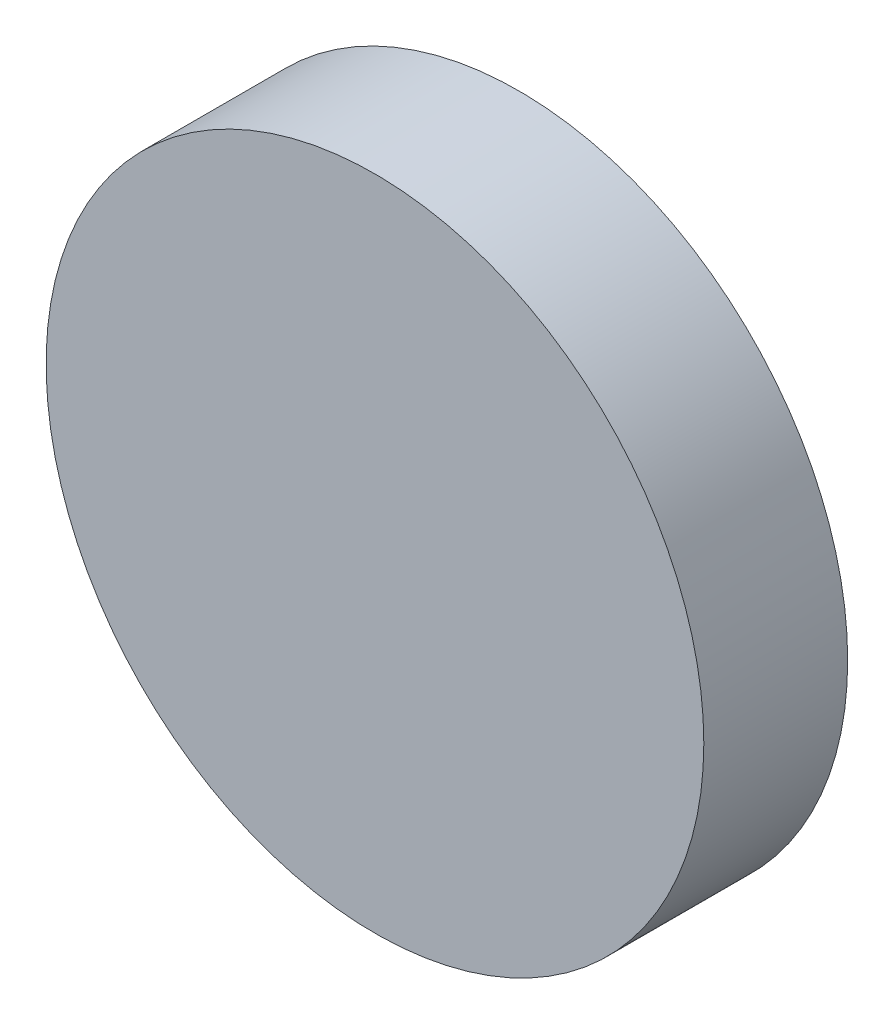
ISO-10303-21;
HEADER;
FILE_DESCRIPTION(('STEP AP214'),'2;1');
FILE_NAME('part.step','',(''),(''),'','','');
FILE_SCHEMA(('AUTOMOTIVE_DESIGN { 1 0 10303 214 1 1 1 1 }'));
ENDSEC;
DATA;
#1=APPLICATION_CONTEXT('core data for automotive mechanical design processes');
#2=APPLICATION_PROTOCOL_DEFINITION('international standard','automotive_design',2000,#1);
#3=PRODUCT_CONTEXT('',#1,'mechanical');
#4=PRODUCT('Part','Part','',(#3));
#5=PRODUCT_RELATED_PRODUCT_CATEGORY('part','',(#4));
#6=PRODUCT_DEFINITION_FORMATION('','',#4);
#7=PRODUCT_DEFINITION_CONTEXT('part definition',#1,'design');
#8=PRODUCT_DEFINITION('design','',#6,#7);
#9=PRODUCT_DEFINITION_SHAPE('','',#8);
#10=(LENGTH_UNIT() NAMED_UNIT(*) SI_UNIT(.MILLI.,.METRE.));
#11=(NAMED_UNIT(*) PLANE_ANGLE_UNIT() SI_UNIT($,.RADIAN.));
#12=(NAMED_UNIT(*) SI_UNIT($,.STERADIAN.) SOLID_ANGLE_UNIT());
#13=UNCERTAINTY_MEASURE_WITH_UNIT(LENGTH_MEASURE(1.E-05),#10,'distance_accuracy_value','');
#14=(GEOMETRIC_REPRESENTATION_CONTEXT(3) GLOBAL_UNCERTAINTY_ASSIGNED_CONTEXT((#13)) GLOBAL_UNIT_ASSIGNED_CONTEXT((#10,
#11,#12)) REPRESENTATION_CONTEXT('',''));
#15=CARTESIAN_POINT('',(0.,0.,0.));
#16=DIRECTION('',(0.,0.,1.));
#17=DIRECTION('',(1.,0.,0.));
#18=AXIS2_PLACEMENT_3D('',#15,#16,#17);
#19=CARTESIAN_POINT('',(13.5413484331681,6.62676831259947,34.0000000000001));
#20=DIRECTION('',(0.,0.,1.));
#21=DIRECTION('',(1.,0.,0.));
#22=AXIS2_PLACEMENT_3D('',#19,#20,#21);
#23=PLANE('',#22);
#24=CARTESIAN_POINT('',(13.5413484331681,6.62676831259947,34.0000000000001));
#25=DIRECTION('',(0.,0.,1.));
#26=DIRECTION('',(1.,0.,0.));
#27=AXIS2_PLACEMENT_3D('',#24,#25,#26);
#28=CIRCLE('',#27,40.);
#29=CARTESIAN_POINT('',(53.5413484331682,6.62676831259947,34.0000000000001));
#30=VERTEX_POINT('',#29);
#31=EDGE_CURVE('E52',#30,#30,#28,.T.);
#32=ORIENTED_EDGE('',*,*,#31,.F.);
#33=EDGE_LOOP('',(#32));
#34=FACE_BOUND('',#33,.T.);
#35=CARTESIAN_POINT('',(13.5413484331682,6.62676831259954,34.0000000000001));
#36=DIRECTION('',(0.,0.,1.));
#37=DIRECTION('',(1.,0.,0.));
#38=AXIS2_PLACEMENT_3D('',#35,#36,#37);
#39=CIRCLE('',#38,37.5);
#40=CARTESIAN_POINT('',(51.0413484331682,6.62676831259954,34.0000000000001));
#41=VERTEX_POINT('',#40);
#42=EDGE_CURVE('E56',#41,#41,#39,.T.);
#43=ORIENTED_EDGE('',*,*,#42,.T.);
#44=EDGE_LOOP('',(#43));
#45=FACE_BOUND('',#44,.T.);
#46=ADVANCED_FACE('F45',(#34,#45),#23,.F.);
#47=CARTESIAN_POINT('',(13.5413484331681,6.62676831259947,46.0000000000001));
#48=DIRECTION('',(0.,0.,-1.));
#49=DIRECTION('',(-1.,0.,0.));
#50=AXIS2_PLACEMENT_3D('',#47,#48,#49);
#51=CYLINDRICAL_SURFACE('',#50,40.);
#52=ORIENTED_EDGE('',*,*,#31,.T.);
#53=EDGE_LOOP('',(#52));
#54=FACE_BOUND('',#53,.T.);
#55=CARTESIAN_POINT('',(13.5413484331681,6.62676831259947,51.5000000000001));
#56=DIRECTION('',(0.,0.,1.));
#57=DIRECTION('',(1.,0.,0.));
#58=AXIS2_PLACEMENT_3D('',#55,#56,#57);
#59=CIRCLE('',#58,40.);
#60=CARTESIAN_POINT('',(53.5413484331682,6.62676831259947,51.5000000000001));
#61=VERTEX_POINT('',#60);
#62=EDGE_CURVE('E65',#61,#61,#59,.T.);
#63=ORIENTED_EDGE('',*,*,#62,.F.);
#64=EDGE_LOOP('',(#63));
#65=FACE_BOUND('',#64,.T.);
#66=ADVANCED_FACE('F47',(#54,#65),#51,.T.);
#67=CARTESIAN_POINT('',(13.5413484331682,6.62676831259954,46.0000000000001));
#68=DIRECTION('',(0.,0.,-1.));
#69=DIRECTION('',(-1.,0.,0.));
#70=AXIS2_PLACEMENT_3D('',#67,#68,#69);
#71=CYLINDRICAL_SURFACE('',#70,37.5);
#72=ORIENTED_EDGE('',*,*,#42,.F.);
#73=EDGE_LOOP('',(#72));
#74=FACE_BOUND('',#73,.T.);
#75=CARTESIAN_POINT('',(13.5413484331682,6.62676831259954,49.0000000000001));
#76=DIRECTION('',(0.,0.,1.));
#77=DIRECTION('',(0.,-1.,0.));
#78=AXIS2_PLACEMENT_3D('',#75,#76,#77);
#79=CIRCLE('',#78,37.5);
#80=CARTESIAN_POINT('',(13.5413484331682,-30.8732316874005,49.0000000000001));
#81=VERTEX_POINT('',#80);
#82=EDGE_CURVE('E60',#81,#81,#79,.F.);
#83=ORIENTED_EDGE('',*,*,#82,.F.);
#84=EDGE_LOOP('',(#83));
#85=FACE_BOUND('',#84,.T.);
#86=ADVANCED_FACE('F87',(#74,#85),#71,.F.);
#87=CARTESIAN_POINT('',(13.5413484331681,6.62676831259947,49.0000000000001));
#88=DIRECTION('',(0.,0.,1.));
#89=DIRECTION('',(1.,0.,0.));
#90=AXIS2_PLACEMENT_3D('',#87,#88,#89);
#91=PLANE('',#90);
#92=CARTESIAN_POINT('',(13.5413484331682,6.62676831259954,49.0000000000001));
#93=DIRECTION('',(0.,0.,1.));
#94=DIRECTION('',(1.,0.,0.));
#95=AXIS2_PLACEMENT_3D('',#92,#93,#94);
#96=CIRCLE('',#95,35.);
#97=CARTESIAN_POINT('',(48.5413484331682,6.62676831259954,49.0000000000001));
#98=VERTEX_POINT('',#97);
#99=EDGE_CURVE('E11',#98,#98,#96,.F.);
#100=ORIENTED_EDGE('',*,*,#99,.F.);
#101=EDGE_LOOP('',(#100));
#102=FACE_BOUND('',#101,.T.);
#103=ORIENTED_EDGE('',*,*,#82,.T.);
#104=EDGE_LOOP('',(#103));
#105=FACE_BOUND('',#104,.T.);
#106=ADVANCED_FACE('F92',(#102,#105),#91,.F.);
#107=CARTESIAN_POINT('',(13.5413484331681,6.62676831259947,51.5000000000001));
#108=DIRECTION('',(0.,0.,1.));
#109=DIRECTION('',(1.,0.,0.));
#110=AXIS2_PLACEMENT_3D('',#107,#108,#109);
#111=PLANE('',#110);
#112=ORIENTED_EDGE('',*,*,#62,.T.);
#113=EDGE_LOOP('',(#112));
#114=FACE_BOUND('',#113,.T.);
#115=ADVANCED_FACE('F80',(#114),#111,.T.);
#116=CARTESIAN_POINT('',(13.5413484331682,6.62676831259954,162.137084989848));
#117=DIRECTION('',(0.,0.,-1.));
#118=DIRECTION('',(-1.,0.,0.));
#119=AXIS2_PLACEMENT_3D('',#116,#117,#118);
#120=CYLINDRICAL_SURFACE('',#119,35.);
#121=CARTESIAN_POINT('',(13.5413484331682,6.62676831259954,46.0000000000001));
#122=DIRECTION('',(0.,0.,1.));
#123=DIRECTION('',(1.,0.,0.));
#124=AXIS2_PLACEMENT_3D('',#121,#122,#123);
#125=CIRCLE('',#124,35.);
#126=CARTESIAN_POINT('',(48.5413484331682,6.62676831259954,46.0000000000001));
#127=VERTEX_POINT('',#126);
#128=EDGE_CURVE('E68',#127,#127,#125,.T.);
#129=ORIENTED_EDGE('',*,*,#128,.T.);
#130=EDGE_LOOP('',(#129));
#131=FACE_BOUND('',#130,.T.);
#132=ORIENTED_EDGE('',*,*,#99,.T.);
#133=EDGE_LOOP('',(#132));
#134=FACE_BOUND('',#133,.T.);
#135=ADVANCED_FACE('F72',(#131,#134),#120,.T.);
#136=CARTESIAN_POINT('',(0.,0.,46.0000000000001));
#137=DIRECTION('',(0.,0.,1.));
#138=DIRECTION('',(1.,0.,0.));
#139=AXIS2_PLACEMENT_3D('',#136,#137,#138);
#140=PLANE('',#139);
#141=ORIENTED_EDGE('',*,*,#128,.F.);
#142=EDGE_LOOP('',(#141));
#143=FACE_BOUND('',#142,.T.);
#144=ADVANCED_FACE('F74',(#143),#140,.F.);
#145=CLOSED_SHELL('',(#46,#66,#86,#106,#115,#135,#144));
#146=MANIFOLD_SOLID_BREP('B2',#145);
#147=ADVANCED_BREP_SHAPE_REPRESENTATION('',(#18,#146),#14);
#148=SHAPE_DEFINITION_REPRESENTATION(#9,#147);
ENDSEC;
END-ISO-10303-21;
